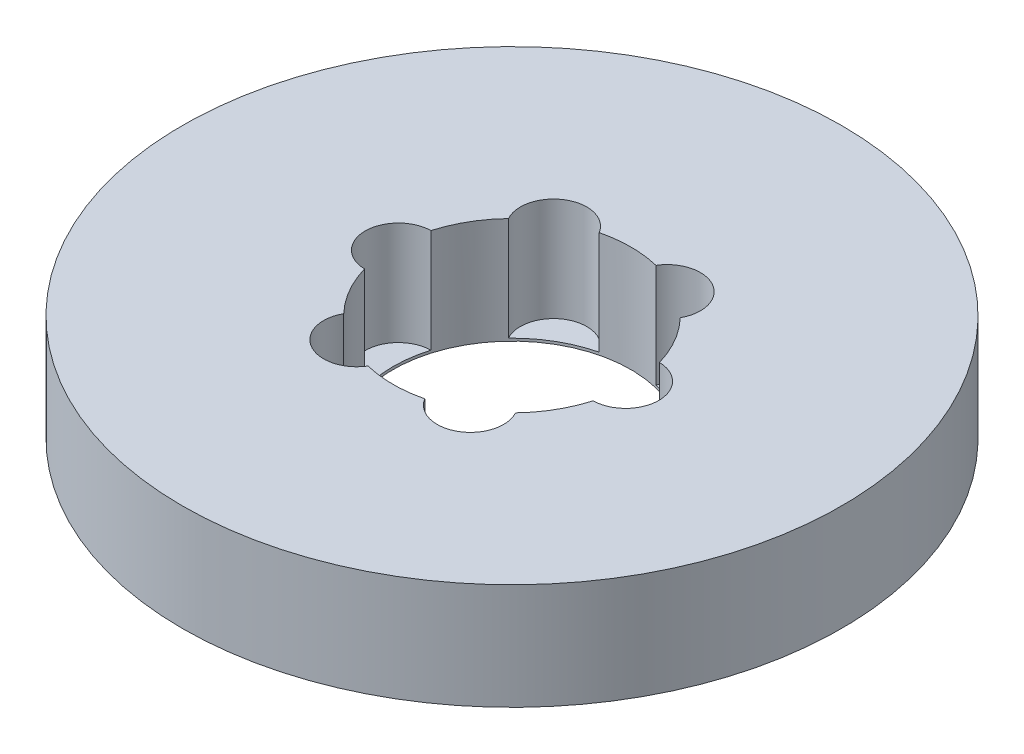
ISO-10303-21;
HEADER;
FILE_DESCRIPTION(('STEP AP214'),'2;1');
FILE_NAME('part.step','',(''),(''),'','','');
FILE_SCHEMA(('AUTOMOTIVE_DESIGN { 1 0 10303 214 1 1 1 1 }'));
ENDSEC;
DATA;
#1=APPLICATION_CONTEXT('core data for automotive mechanical design processes');
#2=APPLICATION_PROTOCOL_DEFINITION('international standard','automotive_design',2000,#1);
#3=PRODUCT_CONTEXT('',#1,'mechanical');
#4=PRODUCT('Part','Part','',(#3));
#5=PRODUCT_RELATED_PRODUCT_CATEGORY('part','',(#4));
#6=PRODUCT_DEFINITION_FORMATION('','',#4);
#7=PRODUCT_DEFINITION_CONTEXT('part definition',#1,'design');
#8=PRODUCT_DEFINITION('design','',#6,#7);
#9=PRODUCT_DEFINITION_SHAPE('','',#8);
#10=(LENGTH_UNIT() NAMED_UNIT(*) SI_UNIT(.MILLI.,.METRE.));
#11=(NAMED_UNIT(*) PLANE_ANGLE_UNIT() SI_UNIT($,.RADIAN.));
#12=(NAMED_UNIT(*) SI_UNIT($,.STERADIAN.) SOLID_ANGLE_UNIT());
#13=UNCERTAINTY_MEASURE_WITH_UNIT(LENGTH_MEASURE(1.E-05),#10,'distance_accuracy_value','');
#14=(GEOMETRIC_REPRESENTATION_CONTEXT(3) GLOBAL_UNCERTAINTY_ASSIGNED_CONTEXT((#13)) GLOBAL_UNIT_ASSIGNED_CONTEXT((#10,
#11,#12)) REPRESENTATION_CONTEXT('',''));
#15=CARTESIAN_POINT('',(0.,0.,0.));
#16=DIRECTION('',(0.,0.,1.));
#17=DIRECTION('',(1.,0.,0.));
#18=AXIS2_PLACEMENT_3D('',#15,#16,#17);
#19=CARTESIAN_POINT('',(0.,29.,0.));
#20=DIRECTION('',(0.,-1.,0.));
#21=DIRECTION('',(0.,0.,-1.));
#22=AXIS2_PLACEMENT_3D('',#19,#20,#21);
#23=CYLINDRICAL_SURFACE('',#22,90.);
#24=CARTESIAN_POINT('',(0.,29.,0.));
#25=DIRECTION('',(0.,1.,0.));
#26=DIRECTION('',(0.,0.,1.));
#27=AXIS2_PLACEMENT_3D('',#24,#25,#26);
#28=CIRCLE('',#27,90.);
#29=CARTESIAN_POINT('',(0.,29.,-90.));
#30=VERTEX_POINT('',#29);
#31=EDGE_CURVE('E162',#30,#30,#28,.T.);
#32=CARTESIAN_POINT('',(0.,0.,0.));
#33=DIRECTION('',(0.,1.,0.));
#34=DIRECTION('',(0.,0.,1.));
#35=AXIS2_PLACEMENT_3D('',#32,#33,#34);
#36=CIRCLE('',#35,90.);
#37=CARTESIAN_POINT('',(0.,0.,-90.));
#38=VERTEX_POINT('',#37);
#39=EDGE_CURVE('E157',#38,#38,#36,.T.);
#40=CARTESIAN_POINT('',(0.,29.,-90.));
#41=CARTESIAN_POINT('',(0.,28.6979166666667,-90.));
#42=CARTESIAN_POINT('',(0.,28.3958333333333,-90.));
#43=CARTESIAN_POINT('',(0.,27.7916666666667,-90.));
#44=CARTESIAN_POINT('',(0.,27.4895833333333,-90.));
#45=CARTESIAN_POINT('',(0.,26.8854166666667,-90.));
#46=CARTESIAN_POINT('',(0.,26.5833333333333,-90.));
#47=CARTESIAN_POINT('',(0.,25.9791666666667,-90.));
#48=CARTESIAN_POINT('',(0.,25.6770833333333,-90.));
#49=CARTESIAN_POINT('',(0.,25.0729166666667,-90.));
#50=CARTESIAN_POINT('',(0.,24.7708333333333,-90.));
#51=CARTESIAN_POINT('',(0.,24.1666666666667,-90.));
#52=CARTESIAN_POINT('',(0.,23.8645833333333,-90.));
#53=CARTESIAN_POINT('',(0.,23.2604166666667,-90.));
#54=CARTESIAN_POINT('',(0.,22.9583333333333,-90.));
#55=CARTESIAN_POINT('',(0.,22.3541666666667,-90.));
#56=CARTESIAN_POINT('',(0.,22.0520833333333,-90.));
#57=CARTESIAN_POINT('',(0.,21.4479166666667,-90.));
#58=CARTESIAN_POINT('',(0.,21.1458333333333,-90.));
#59=CARTESIAN_POINT('',(0.,20.5416666666667,-90.));
#60=CARTESIAN_POINT('',(0.,20.2395833333333,-90.));
#61=CARTESIAN_POINT('',(0.,19.6354166666667,-90.));
#62=CARTESIAN_POINT('',(0.,19.3333333333333,-90.));
#63=CARTESIAN_POINT('',(0.,18.7291666666667,-90.));
#64=CARTESIAN_POINT('',(0.,18.4270833333333,-90.));
#65=CARTESIAN_POINT('',(0.,17.8229166666667,-90.));
#66=CARTESIAN_POINT('',(0.,17.5208333333333,-90.));
#67=CARTESIAN_POINT('',(0.,16.9166666666667,-90.));
#68=CARTESIAN_POINT('',(0.,16.6145833333333,-90.));
#69=CARTESIAN_POINT('',(0.,16.0104166666667,-90.));
#70=CARTESIAN_POINT('',(0.,15.7083333333333,-90.));
#71=CARTESIAN_POINT('',(0.,15.1041666666667,-90.));
#72=CARTESIAN_POINT('',(0.,14.8020833333333,-90.));
#73=CARTESIAN_POINT('',(0.,14.1979166666667,-90.));
#74=CARTESIAN_POINT('',(0.,13.8958333333333,-90.));
#75=CARTESIAN_POINT('',(0.,13.2916666666667,-90.));
#76=CARTESIAN_POINT('',(0.,12.9895833333333,-90.));
#77=CARTESIAN_POINT('',(0.,12.3854166666667,-90.));
#78=CARTESIAN_POINT('',(0.,12.0833333333333,-90.));
#79=CARTESIAN_POINT('',(0.,11.4791666666667,-90.));
#80=CARTESIAN_POINT('',(0.,11.1770833333333,-90.));
#81=CARTESIAN_POINT('',(0.,10.5729166666667,-90.));
#82=CARTESIAN_POINT('',(0.,10.2708333333333,-90.));
#83=CARTESIAN_POINT('',(0.,9.66666666666667,-90.));
#84=CARTESIAN_POINT('',(0.,9.36458333333333,-90.));
#85=CARTESIAN_POINT('',(0.,8.76041666666667,-90.));
#86=CARTESIAN_POINT('',(0.,8.45833333333333,-90.));
#87=CARTESIAN_POINT('',(0.,7.85416666666667,-90.));
#88=CARTESIAN_POINT('',(0.,7.55208333333333,-90.));
#89=CARTESIAN_POINT('',(0.,6.94791666666667,-90.));
#90=CARTESIAN_POINT('',(0.,6.64583333333333,-90.));
#91=CARTESIAN_POINT('',(0.,6.04166666666667,-90.));
#92=CARTESIAN_POINT('',(0.,5.73958333333333,-90.));
#93=CARTESIAN_POINT('',(0.,5.13541666666667,-90.));
#94=CARTESIAN_POINT('',(0.,4.83333333333333,-90.));
#95=CARTESIAN_POINT('',(0.,4.22916666666667,-90.));
#96=CARTESIAN_POINT('',(0.,3.92708333333333,-90.));
#97=CARTESIAN_POINT('',(0.,3.32291666666667,-90.));
#98=CARTESIAN_POINT('',(0.,3.02083333333333,-90.));
#99=CARTESIAN_POINT('',(0.,2.41666666666667,-90.));
#100=CARTESIAN_POINT('',(0.,2.11458333333333,-90.));
#101=CARTESIAN_POINT('',(0.,1.51041666666667,-90.));
#102=CARTESIAN_POINT('',(0.,1.20833333333333,-90.));
#103=CARTESIAN_POINT('',(0.,0.604166666666667,-90.));
#104=CARTESIAN_POINT('',(0.,0.302083333333333,-90.));
#105=CARTESIAN_POINT('',(0.,0.,-90.));
#106=B_SPLINE_CURVE_WITH_KNOTS('',3,(#40,#41,#42,#43,#44,#45,#46,#47,#48,#49,#50,#51,#52,#53,
#54,#55,#56,#57,#58,#59,#60,#61,#62,#63,#64,#65,#66,#67,#68,#69,#70,#71,#72,#73,#74,#75,#76,#77,
#78,#79,#80,#81,#82,#83,#84,#85,#86,#87,#88,#89,#90,#91,#92,#93,#94,#95,#96,#97,#98,#99,#100,
#101,#102,#103,#104,#105),.UNSPECIFIED.,.F.,.F.,(4,2,2,2,2,2,2,2,2,2,2,2,2,2,2,2,2,2,2,2,2,2,2,
2,2,2,2,2,2,2,2,2,4),(0.,0.906250000000001,1.8125,2.71875,3.625,4.53125,5.4375,6.34375,7.25,
8.15625,9.0625,9.96875,10.875,11.78125,12.6875,13.59375,14.5,15.40625,16.3125,17.21875,18.125,
19.03125,19.9375,20.84375,21.75,22.65625,23.5625,24.46875,25.375,26.28125,27.1875,28.09375,29.),.UNSPECIFIED.);
#107=EDGE_CURVE('BSEAM39',#30,#38,#106,.T.);
#108=ORIENTED_EDGE('',*,*,#31,.F.);
#109=ORIENTED_EDGE('',*,*,#39,.T.);
#110=ORIENTED_EDGE('',*,*,#107,.T.);
#111=ORIENTED_EDGE('',*,*,#107,.F.);
#112=EDGE_LOOP('',(#108,#110,#109,#111));
#113=FACE_BOUND('',#112,.T.);
#114=ADVANCED_FACE('F39',(#113),#23,.T.);
#115=CARTESIAN_POINT('',(0.,29.,0.));
#116=DIRECTION('',(0.,1.,0.));
#117=DIRECTION('',(0.,0.,1.));
#118=AXIS2_PLACEMENT_3D('',#115,#116,#117);
#119=PLANE('',#118);
#120=CARTESIAN_POINT('',(-15.5113171343184,29.,-26.8663893689524));
#121=DIRECTION('',(0.,1.,0.));
#122=DIRECTION('',(-0.866025403784433,0.,0.50000000000001));
#123=AXIS2_PLACEMENT_3D('',#120,#121,#122);
#124=CIRCLE('',#123,9.07268553633384);
#125=CARTESIAN_POINT('',(-7.74872656399803,29.,-31.562750777402));
#126=VERTEX_POINT('',#125);
#127=CARTESIAN_POINT('',(-23.4597807045487,29.,-22.4919694401021));
#128=VERTEX_POINT('',#127);
#129=EDGE_CURVE('E218',#126,#128,#124,.T.);
#130=ORIENTED_EDGE('',*,*,#129,.F.);
#131=CARTESIAN_POINT('',(0.,29.,0.));
#132=DIRECTION('',(0.,1.,0.));
#133=DIRECTION('',(0.,0.,1.));
#134=AXIS2_PLACEMENT_3D('',#131,#132,#133);
#135=CIRCLE('',#134,32.5);
#136=CARTESIAN_POINT('',(7.74872656399738,29.,-31.5627507774022));
#137=VERTEX_POINT('',#136);
#138=EDGE_CURVE('E169',#137,#126,#135,.T.);
#139=ORIENTED_EDGE('',*,*,#138,.F.);
#140=CARTESIAN_POINT('',(15.5113171343178,29.,-26.8663893689527));
#141=DIRECTION('',(0.,1.,0.));
#142=DIRECTION('',(-0.866025403784443,0.,-0.499999999999992));
#143=AXIS2_PLACEMENT_3D('',#140,#141,#142);
#144=CIRCLE('',#143,9.07268553633384);
#145=CARTESIAN_POINT('',(23.4597807045482,29.,-22.4919694401026));
#146=VERTEX_POINT('',#145);
#147=EDGE_CURVE('E285',#146,#137,#144,.T.);
#148=ORIENTED_EDGE('',*,*,#147,.F.);
#149=CARTESIAN_POINT('',(31.2085072685461,29.,-9.07078133729977));
#150=VERTEX_POINT('',#149);
#151=EDGE_CURVE('E174',#150,#146,#135,.T.);
#152=ORIENTED_EDGE('',*,*,#151,.F.);
#153=CARTESIAN_POINT('',(31.0226342686362,29.,0.));
#154=DIRECTION('',(0.,1.,0.));
#155=DIRECTION('',(0.,0.,-1.));
#156=AXIS2_PLACEMENT_3D('',#153,#154,#155);
#157=CIRCLE('',#156,9.07268553633384);
#158=CARTESIAN_POINT('',(31.2085072685461,29.,9.07078133729977));
#159=VERTEX_POINT('',#158);
#160=EDGE_CURVE('E280',#159,#150,#157,.T.);
#161=ORIENTED_EDGE('',*,*,#160,.F.);
#162=CARTESIAN_POINT('',(23.4597807045485,29.,22.4919694401022));
#163=VERTEX_POINT('',#162);
#164=EDGE_CURVE('E164',#163,#159,#135,.T.);
#165=ORIENTED_EDGE('',*,*,#164,.F.);
#166=CARTESIAN_POINT('',(15.5113171343182,29.,26.8663893689525));
#167=DIRECTION('',(0.,1.,0.));
#168=DIRECTION('',(0.866025403784436,0.,-0.500000000000004));
#169=AXIS2_PLACEMENT_3D('',#166,#167,#168);
#170=CIRCLE('',#169,9.07268553633384);
#171=CARTESIAN_POINT('',(7.74872656399781,29.,31.5627507774021));
#172=VERTEX_POINT('',#171);
#173=EDGE_CURVE('E269',#172,#163,#170,.T.);
#174=ORIENTED_EDGE('',*,*,#173,.F.);
#175=CARTESIAN_POINT('',(-7.74872656399759,29.,31.5627507774021));
#176=VERTEX_POINT('',#175);
#177=EDGE_CURVE('E149',#176,#172,#135,.T.);
#178=ORIENTED_EDGE('',*,*,#177,.F.);
#179=CARTESIAN_POINT('',(-15.511317134318,29.,26.8663893689526));
#180=DIRECTION('',(0.,1.,0.));
#181=DIRECTION('',(0.86602540378444,0.,0.499999999999998));
#182=AXIS2_PLACEMENT_3D('',#179,#180,#181);
#183=CIRCLE('',#182,9.07268553633384);
#184=CARTESIAN_POINT('',(-23.4597807045484,29.,22.4919694401024));
#185=VERTEX_POINT('',#184);
#186=EDGE_CURVE('E128',#185,#176,#183,.T.);
#187=ORIENTED_EDGE('',*,*,#186,.F.);
#188=CARTESIAN_POINT('',(-31.2085072685461,29.,9.07078133729977));
#189=VERTEX_POINT('',#188);
#190=EDGE_CURVE('E148',#189,#185,#135,.T.);
#191=ORIENTED_EDGE('',*,*,#190,.F.);
#192=CARTESIAN_POINT('',(-31.0226342686362,29.,0.));
#193=DIRECTION('',(0.,1.,0.));
#194=DIRECTION('',(0.,0.,1.));
#195=AXIS2_PLACEMENT_3D('',#192,#193,#194);
#196=CIRCLE('',#195,9.07268553633384);
#197=CARTESIAN_POINT('',(-31.2085072685461,29.,-9.07078133729977));
#198=VERTEX_POINT('',#197);
#199=EDGE_CURVE('E179',#198,#189,#196,.T.);
#200=ORIENTED_EDGE('',*,*,#199,.F.);
#201=EDGE_CURVE('E161',#128,#198,#135,.T.);
#202=ORIENTED_EDGE('',*,*,#201,.F.);
#203=EDGE_LOOP('',(#130,#139,#148,#152,#161,#165,#174,#178,#187,#191,#200,#202));
#204=FACE_BOUND('',#203,.T.);
#205=ORIENTED_EDGE('',*,*,#31,.T.);
#206=EDGE_LOOP('',(#205));
#207=FACE_BOUND('',#206,.T.);
#208=ADVANCED_FACE('F141',(#204,#207),#119,.T.);
#209=CARTESIAN_POINT('',(0.,0.,0.));
#210=DIRECTION('',(0.,1.,0.));
#211=DIRECTION('',(0.,0.,1.));
#212=AXIS2_PLACEMENT_3D('',#209,#210,#211);
#213=PLANE('',#212);
#214=CARTESIAN_POINT('',(0.,0.,0.));
#215=DIRECTION('',(0.,1.,0.));
#216=DIRECTION('',(0.,0.,1.));
#217=AXIS2_PLACEMENT_3D('',#214,#215,#216);
#218=CIRCLE('',#217,32.5);
#219=CARTESIAN_POINT('',(0.,0.,32.5));
#220=VERTEX_POINT('',#219);
#221=EDGE_CURVE('E166',#220,#220,#218,.T.);
#222=ORIENTED_EDGE('',*,*,#221,.T.);
#223=EDGE_LOOP('',(#222));
#224=FACE_BOUND('',#223,.T.);
#225=ORIENTED_EDGE('',*,*,#39,.F.);
#226=EDGE_LOOP('',(#225));
#227=FACE_BOUND('',#226,.T.);
#228=ADVANCED_FACE('F234',(#224,#227),#213,.F.);
#229=CARTESIAN_POINT('',(0.,29.,0.));
#230=DIRECTION('',(0.,-1.,0.));
#231=DIRECTION('',(0.,0.,-1.));
#232=AXIS2_PLACEMENT_3D('',#229,#230,#231);
#233=CYLINDRICAL_SURFACE('',#232,32.5);
#234=DIRECTION('',(0.,1.,0.));
#235=VECTOR('',#234,1.);
#236=CARTESIAN_POINT('',(-7.74872656399803,14.8580081509842,-31.562750777402));
#237=LINE('',#236,#235);
#238=CARTESIAN_POINT('',(-7.74872656399803,0.71601630196845,-31.562750777402));
#239=VERTEX_POINT('',#238);
#240=EDGE_CURVE('E11',#239,#126,#237,.T.);
#241=ORIENTED_EDGE('',*,*,#240,.F.);
#242=CARTESIAN_POINT('',(0.,0.71601630196845,0.));
#243=DIRECTION('',(0.,1.,0.));
#244=DIRECTION('',(0.,0.,1.));
#245=AXIS2_PLACEMENT_3D('',#242,#243,#244);
#246=CIRCLE('',#245,32.5);
#247=CARTESIAN_POINT('',(-23.4597807045487,0.71601630196845,-22.4919694401021));
#248=VERTEX_POINT('',#247);
#249=EDGE_CURVE('E214',#239,#248,#246,.T.);
#250=ORIENTED_EDGE('',*,*,#249,.T.);
#251=DIRECTION('',(0.,1.,0.));
#252=VECTOR('',#251,1.);
#253=CARTESIAN_POINT('',(-23.4597807045487,14.8580081509842,-22.4919694401021));
#254=LINE('',#253,#252);
#255=EDGE_CURVE('E46',#128,#248,#254,.F.);
#256=ORIENTED_EDGE('',*,*,#255,.F.);
#257=ORIENTED_EDGE('',*,*,#201,.T.);
#258=DIRECTION('',(0.,1.,0.));
#259=VECTOR('',#258,1.);
#260=CARTESIAN_POINT('',(-31.2085072685461,14.8580081509842,-9.07078133729977));
#261=LINE('',#260,#259);
#262=CARTESIAN_POINT('',(-31.2085072685461,0.71601630196845,-9.07078133729977));
#263=VERTEX_POINT('',#262);
#264=EDGE_CURVE('E187',#263,#198,#261,.T.);
#265=ORIENTED_EDGE('',*,*,#264,.F.);
#266=CARTESIAN_POINT('',(0.,0.71601630196845,0.));
#267=DIRECTION('',(0.,1.,0.));
#268=DIRECTION('',(0.,0.,1.));
#269=AXIS2_PLACEMENT_3D('',#266,#267,#268);
#270=CIRCLE('',#269,32.5);
#271=CARTESIAN_POINT('',(-31.2085072685461,0.71601630196845,9.07078133729977));
#272=VERTEX_POINT('',#271);
#273=EDGE_CURVE('E184',#263,#272,#270,.T.);
#274=ORIENTED_EDGE('',*,*,#273,.T.);
#275=DIRECTION('',(0.,1.,0.));
#276=VECTOR('',#275,1.);
#277=CARTESIAN_POINT('',(-31.2085072685461,14.8580081509842,9.07078133729977));
#278=LINE('',#277,#276);
#279=EDGE_CURVE('E158',#189,#272,#278,.F.);
#280=ORIENTED_EDGE('',*,*,#279,.F.);
#281=ORIENTED_EDGE('',*,*,#190,.T.);
#282=DIRECTION('',(0.,1.,0.));
#283=VECTOR('',#282,1.);
#284=CARTESIAN_POINT('',(-23.4597807045484,14.8580081509842,22.4919694401024));
#285=LINE('',#284,#283);
#286=CARTESIAN_POINT('',(-23.4597807045484,0.71601630196845,22.4919694401024));
#287=VERTEX_POINT('',#286);
#288=EDGE_CURVE('E127',#287,#185,#285,.T.);
#289=ORIENTED_EDGE('',*,*,#288,.F.);
#290=CARTESIAN_POINT('',(0.,0.71601630196845,0.));
#291=DIRECTION('',(0.,1.,0.));
#292=DIRECTION('',(0.,0.,1.));
#293=AXIS2_PLACEMENT_3D('',#290,#291,#292);
#294=CIRCLE('',#293,32.5);
#295=CARTESIAN_POINT('',(-7.74872656399759,0.71601630196845,31.5627507774021));
#296=VERTEX_POINT('',#295);
#297=EDGE_CURVE('E189',#287,#296,#294,.T.);
#298=ORIENTED_EDGE('',*,*,#297,.T.);
#299=DIRECTION('',(0.,1.,0.));
#300=VECTOR('',#299,1.);
#301=CARTESIAN_POINT('',(-7.74872656399759,14.8580081509842,31.5627507774021));
#302=LINE('',#301,#300);
#303=EDGE_CURVE('E140',#176,#296,#302,.F.);
#304=ORIENTED_EDGE('',*,*,#303,.F.);
#305=ORIENTED_EDGE('',*,*,#177,.T.);
#306=DIRECTION('',(0.,1.,0.));
#307=VECTOR('',#306,1.);
#308=CARTESIAN_POINT('',(7.74872656399781,14.8580081509842,31.5627507774021));
#309=LINE('',#308,#307);
#310=CARTESIAN_POINT('',(7.74872656399781,0.71601630196845,31.5627507774021));
#311=VERTEX_POINT('',#310);
#312=EDGE_CURVE('E196',#311,#172,#309,.T.);
#313=ORIENTED_EDGE('',*,*,#312,.F.);
#314=CARTESIAN_POINT('',(0.,0.71601630196845,0.));
#315=DIRECTION('',(0.,1.,0.));
#316=DIRECTION('',(0.,0.,1.));
#317=AXIS2_PLACEMENT_3D('',#314,#315,#316);
#318=CIRCLE('',#317,32.5);
#319=CARTESIAN_POINT('',(23.4597807045485,0.71601630196845,22.4919694401022));
#320=VERTEX_POINT('',#319);
#321=EDGE_CURVE('E136',#311,#320,#318,.T.);
#322=ORIENTED_EDGE('',*,*,#321,.T.);
#323=DIRECTION('',(0.,1.,0.));
#324=VECTOR('',#323,1.);
#325=CARTESIAN_POINT('',(23.4597807045485,14.8580081509842,22.4919694401022));
#326=LINE('',#325,#324);
#327=EDGE_CURVE('E194',#163,#320,#326,.F.);
#328=ORIENTED_EDGE('',*,*,#327,.F.);
#329=ORIENTED_EDGE('',*,*,#164,.T.);
#330=DIRECTION('',(0.,1.,0.));
#331=VECTOR('',#330,1.);
#332=CARTESIAN_POINT('',(31.2085072685461,14.8580081509842,9.07078133729977));
#333=LINE('',#332,#331);
#334=CARTESIAN_POINT('',(31.2085072685461,0.71601630196845,9.07078133729977));
#335=VERTEX_POINT('',#334);
#336=EDGE_CURVE('E206',#335,#159,#333,.T.);
#337=ORIENTED_EDGE('',*,*,#336,.F.);
#338=CARTESIAN_POINT('',(0.,0.71601630196845,0.));
#339=DIRECTION('',(0.,1.,0.));
#340=DIRECTION('',(0.,0.,1.));
#341=AXIS2_PLACEMENT_3D('',#338,#339,#340);
#342=CIRCLE('',#341,32.5);
#343=CARTESIAN_POINT('',(31.2085072685461,0.71601630196845,-9.07078133729977));
#344=VERTEX_POINT('',#343);
#345=EDGE_CURVE('E199',#335,#344,#342,.T.);
#346=ORIENTED_EDGE('',*,*,#345,.T.);
#347=DIRECTION('',(0.,1.,0.));
#348=VECTOR('',#347,1.);
#349=CARTESIAN_POINT('',(31.2085072685461,14.8580081509842,-9.07078133729977));
#350=LINE('',#349,#348);
#351=EDGE_CURVE('E201',#150,#344,#350,.F.);
#352=ORIENTED_EDGE('',*,*,#351,.F.);
#353=ORIENTED_EDGE('',*,*,#151,.T.);
#354=DIRECTION('',(0.,1.,0.));
#355=VECTOR('',#354,1.);
#356=CARTESIAN_POINT('',(23.4597807045482,14.8580081509842,-22.4919694401026));
#357=LINE('',#356,#355);
#358=CARTESIAN_POINT('',(23.4597807045482,0.71601630196845,-22.4919694401026));
#359=VERTEX_POINT('',#358);
#360=EDGE_CURVE('E213',#359,#146,#357,.T.);
#361=ORIENTED_EDGE('',*,*,#360,.F.);
#362=CARTESIAN_POINT('',(0.,0.71601630196845,0.));
#363=DIRECTION('',(0.,1.,0.));
#364=DIRECTION('',(0.,0.,1.));
#365=AXIS2_PLACEMENT_3D('',#362,#363,#364);
#366=CIRCLE('',#365,32.5);
#367=CARTESIAN_POINT('',(7.74872656399738,0.71601630196845,-31.5627507774022));
#368=VERTEX_POINT('',#367);
#369=EDGE_CURVE('E208',#359,#368,#366,.T.);
#370=ORIENTED_EDGE('',*,*,#369,.T.);
#371=DIRECTION('',(0.,1.,0.));
#372=VECTOR('',#371,1.);
#373=CARTESIAN_POINT('',(7.74872656399737,14.8580081509842,-31.5627507774022));
#374=LINE('',#373,#372);
#375=EDGE_CURVE('E211',#137,#368,#374,.F.);
#376=ORIENTED_EDGE('',*,*,#375,.F.);
#377=ORIENTED_EDGE('',*,*,#138,.T.);
#378=EDGE_LOOP('',(#241,#250,#256,#257,#265,#274,#280,#281,#289,#298,#304,#305,#313,#322,#328,
#329,#337,#346,#352,#353,#361,#370,#376,#377));
#379=FACE_BOUND('',#378,.T.);
#380=ORIENTED_EDGE('',*,*,#221,.F.);
#381=EDGE_LOOP('',(#380));
#382=FACE_BOUND('',#381,.T.);
#383=ADVANCED_FACE('F152',(#379,#382),#233,.F.);
#384=CARTESIAN_POINT('',(-31.0226342686362,0.71601630196845,0.));
#385=DIRECTION('',(0.,1.,0.));
#386=DIRECTION('',(0.,0.,1.));
#387=AXIS2_PLACEMENT_3D('',#384,#385,#386);
#388=CYLINDRICAL_SURFACE('',#387,9.07268553633384);
#389=ORIENTED_EDGE('',*,*,#264,.T.);
#390=ORIENTED_EDGE('',*,*,#199,.T.);
#391=ORIENTED_EDGE('',*,*,#279,.T.);
#392=CARTESIAN_POINT('',(-31.0226342686362,0.71601630196845,0.));
#393=DIRECTION('',(0.,1.,0.));
#394=DIRECTION('',(0.,0.,1.));
#395=AXIS2_PLACEMENT_3D('',#392,#393,#394);
#396=CIRCLE('',#395,9.07268553633384);
#397=EDGE_CURVE('E180',#263,#272,#396,.T.);
#398=ORIENTED_EDGE('',*,*,#397,.F.);
#399=EDGE_LOOP('',(#389,#390,#391,#398));
#400=FACE_BOUND('',#399,.T.);
#401=ADVANCED_FACE('F244',(#400),#388,.F.);
#402=CARTESIAN_POINT('',(-31.0226342686362,0.71601630196845,0.));
#403=DIRECTION('',(0.,1.,0.));
#404=DIRECTION('',(0.,0.,1.));
#405=AXIS2_PLACEMENT_3D('',#402,#403,#404);
#406=PLANE('',#405);
#407=ORIENTED_EDGE('',*,*,#397,.T.);
#408=ORIENTED_EDGE('',*,*,#273,.F.);
#409=EDGE_LOOP('',(#407,#408));
#410=FACE_BOUND('',#409,.T.);
#411=ADVANCED_FACE('F248',(#410),#406,.T.);
#412=CARTESIAN_POINT('',(-15.511317134318,0.71601630196845,26.8663893689526));
#413=DIRECTION('',(0.,1.,0.));
#414=DIRECTION('',(0.,0.,1.));
#415=AXIS2_PLACEMENT_3D('',#412,#413,#414);
#416=CYLINDRICAL_SURFACE('',#415,9.07268553633384);
#417=ORIENTED_EDGE('',*,*,#288,.T.);
#418=ORIENTED_EDGE('',*,*,#186,.T.);
#419=ORIENTED_EDGE('',*,*,#303,.T.);
#420=CARTESIAN_POINT('',(-15.511317134318,0.71601630196845,26.8663893689526));
#421=DIRECTION('',(0.,1.,0.));
#422=DIRECTION('',(0.86602540378444,0.,0.499999999999998));
#423=AXIS2_PLACEMENT_3D('',#420,#421,#422);
#424=CIRCLE('',#423,9.07268553633384);
#425=EDGE_CURVE('E135',#287,#296,#424,.T.);
#426=ORIENTED_EDGE('',*,*,#425,.F.);
#427=EDGE_LOOP('',(#417,#418,#419,#426));
#428=FACE_BOUND('',#427,.T.);
#429=ADVANCED_FACE('F126',(#428),#416,.F.);
#430=CARTESIAN_POINT('',(-15.511317134318,0.71601630196845,26.8663893689526));
#431=DIRECTION('',(0.,1.,0.));
#432=DIRECTION('',(0.86602540378444,0.,0.499999999999998));
#433=AXIS2_PLACEMENT_3D('',#430,#431,#432);
#434=PLANE('',#433);
#435=ORIENTED_EDGE('',*,*,#425,.T.);
#436=ORIENTED_EDGE('',*,*,#297,.F.);
#437=EDGE_LOOP('',(#435,#436));
#438=FACE_BOUND('',#437,.T.);
#439=ADVANCED_FACE('F258',(#438),#434,.T.);
#440=CARTESIAN_POINT('',(15.5113171343182,0.71601630196845,26.8663893689525));
#441=DIRECTION('',(0.,1.,0.));
#442=DIRECTION('',(0.,0.,1.));
#443=AXIS2_PLACEMENT_3D('',#440,#441,#442);
#444=CYLINDRICAL_SURFACE('',#443,9.07268553633384);
#445=ORIENTED_EDGE('',*,*,#312,.T.);
#446=ORIENTED_EDGE('',*,*,#173,.T.);
#447=ORIENTED_EDGE('',*,*,#327,.T.);
#448=CARTESIAN_POINT('',(15.5113171343182,0.71601630196845,26.8663893689525));
#449=DIRECTION('',(0.,1.,0.));
#450=DIRECTION('',(0.866025403784436,0.,-0.500000000000004));
#451=AXIS2_PLACEMENT_3D('',#448,#449,#450);
#452=CIRCLE('',#451,9.07268553633384);
#453=EDGE_CURVE('E147',#311,#320,#452,.T.);
#454=ORIENTED_EDGE('',*,*,#453,.F.);
#455=EDGE_LOOP('',(#445,#446,#447,#454));
#456=FACE_BOUND('',#455,.T.);
#457=ADVANCED_FACE('F256',(#456),#444,.F.);
#458=CARTESIAN_POINT('',(15.5113171343182,0.71601630196845,26.8663893689525));
#459=DIRECTION('',(0.,1.,0.));
#460=DIRECTION('',(0.866025403784436,0.,-0.500000000000004));
#461=AXIS2_PLACEMENT_3D('',#458,#459,#460);
#462=PLANE('',#461);
#463=ORIENTED_EDGE('',*,*,#453,.T.);
#464=ORIENTED_EDGE('',*,*,#321,.F.);
#465=EDGE_LOOP('',(#463,#464));
#466=FACE_BOUND('',#465,.T.);
#467=ADVANCED_FACE('F263',(#466),#462,.T.);
#468=CARTESIAN_POINT('',(31.0226342686362,0.71601630196845,0.));
#469=DIRECTION('',(0.,1.,0.));
#470=DIRECTION('',(0.,0.,1.));
#471=AXIS2_PLACEMENT_3D('',#468,#469,#470);
#472=CYLINDRICAL_SURFACE('',#471,9.07268553633384);
#473=ORIENTED_EDGE('',*,*,#336,.T.);
#474=ORIENTED_EDGE('',*,*,#160,.T.);
#475=ORIENTED_EDGE('',*,*,#351,.T.);
#476=CARTESIAN_POINT('',(31.0226342686362,0.71601630196845,0.));
#477=DIRECTION('',(0.,1.,0.));
#478=DIRECTION('',(0.,0.,-1.));
#479=AXIS2_PLACEMENT_3D('',#476,#477,#478);
#480=CIRCLE('',#479,9.07268553633384);
#481=EDGE_CURVE('E273',#335,#344,#480,.T.);
#482=ORIENTED_EDGE('',*,*,#481,.F.);
#483=EDGE_LOOP('',(#473,#474,#475,#482));
#484=FACE_BOUND('',#483,.T.);
#485=ADVANCED_FACE('F297',(#484),#472,.F.);
#486=CARTESIAN_POINT('',(31.0226342686362,0.71601630196845,0.));
#487=DIRECTION('',(0.,1.,0.));
#488=DIRECTION('',(0.,0.,-1.));
#489=AXIS2_PLACEMENT_3D('',#486,#487,#488);
#490=PLANE('',#489);
#491=ORIENTED_EDGE('',*,*,#481,.T.);
#492=ORIENTED_EDGE('',*,*,#345,.F.);
#493=EDGE_LOOP('',(#491,#492));
#494=FACE_BOUND('',#493,.T.);
#495=ADVANCED_FACE('F299',(#494),#490,.T.);
#496=CARTESIAN_POINT('',(15.5113171343178,0.71601630196845,-26.8663893689527));
#497=DIRECTION('',(0.,1.,0.));
#498=DIRECTION('',(0.,0.,1.));
#499=AXIS2_PLACEMENT_3D('',#496,#497,#498);
#500=CYLINDRICAL_SURFACE('',#499,9.07268553633384);
#501=ORIENTED_EDGE('',*,*,#360,.T.);
#502=ORIENTED_EDGE('',*,*,#147,.T.);
#503=ORIENTED_EDGE('',*,*,#375,.T.);
#504=CARTESIAN_POINT('',(15.5113171343178,0.71601630196845,-26.8663893689527));
#505=DIRECTION('',(0.,1.,0.));
#506=DIRECTION('',(-0.866025403784443,0.,-0.499999999999992));
#507=AXIS2_PLACEMENT_3D('',#504,#505,#506);
#508=CIRCLE('',#507,9.07268553633384);
#509=EDGE_CURVE('E56',#359,#368,#508,.T.);
#510=ORIENTED_EDGE('',*,*,#509,.F.);
#511=EDGE_LOOP('',(#501,#502,#503,#510));
#512=FACE_BOUND('',#511,.T.);
#513=ADVANCED_FACE('F292',(#512),#500,.F.);
#514=CARTESIAN_POINT('',(15.5113171343178,0.71601630196845,-26.8663893689527));
#515=DIRECTION('',(0.,1.,0.));
#516=DIRECTION('',(-0.866025403784443,0.,-0.499999999999992));
#517=AXIS2_PLACEMENT_3D('',#514,#515,#516);
#518=PLANE('',#517);
#519=ORIENTED_EDGE('',*,*,#509,.T.);
#520=ORIENTED_EDGE('',*,*,#369,.F.);
#521=EDGE_LOOP('',(#519,#520));
#522=FACE_BOUND('',#521,.T.);
#523=ADVANCED_FACE('F226',(#522),#518,.T.);
#524=CARTESIAN_POINT('',(-15.5113171343184,0.71601630196845,-26.8663893689524));
#525=DIRECTION('',(0.,1.,0.));
#526=DIRECTION('',(0.,0.,1.));
#527=AXIS2_PLACEMENT_3D('',#524,#525,#526);
#528=CYLINDRICAL_SURFACE('',#527,9.07268553633384);
#529=ORIENTED_EDGE('',*,*,#240,.T.);
#530=ORIENTED_EDGE('',*,*,#129,.T.);
#531=ORIENTED_EDGE('',*,*,#255,.T.);
#532=CARTESIAN_POINT('',(-15.5113171343184,0.71601630196845,-26.8663893689524));
#533=DIRECTION('',(0.,1.,0.));
#534=DIRECTION('',(-0.866025403784433,0.,0.50000000000001));
#535=AXIS2_PLACEMENT_3D('',#532,#533,#534);
#536=CIRCLE('',#535,9.07268553633384);
#537=EDGE_CURVE('E55',#239,#248,#536,.T.);
#538=ORIENTED_EDGE('',*,*,#537,.F.);
#539=EDGE_LOOP('',(#529,#530,#531,#538));
#540=FACE_BOUND('',#539,.T.);
#541=ADVANCED_FACE('F217',(#540),#528,.F.);
#542=CARTESIAN_POINT('',(-15.5113171343184,0.71601630196845,-26.8663893689524));
#543=DIRECTION('',(0.,1.,0.));
#544=DIRECTION('',(-0.866025403784433,0.,0.50000000000001));
#545=AXIS2_PLACEMENT_3D('',#542,#543,#544);
#546=PLANE('',#545);
#547=ORIENTED_EDGE('',*,*,#537,.T.);
#548=ORIENTED_EDGE('',*,*,#249,.F.);
#549=EDGE_LOOP('',(#547,#548));
#550=FACE_BOUND('',#549,.T.);
#551=ADVANCED_FACE('F219',(#550),#546,.T.);
#552=CLOSED_SHELL('',(#114,#208,#228,#383,#401,#411,#429,#439,#457,#467,#485,#495,#513,#523,
#541,#551));
#553=MANIFOLD_SOLID_BREP('B2',#552);
#554=ADVANCED_BREP_SHAPE_REPRESENTATION('',(#18,#553),#14);
#555=SHAPE_DEFINITION_REPRESENTATION(#9,#554);
ENDSEC;
END-ISO-10303-21;
